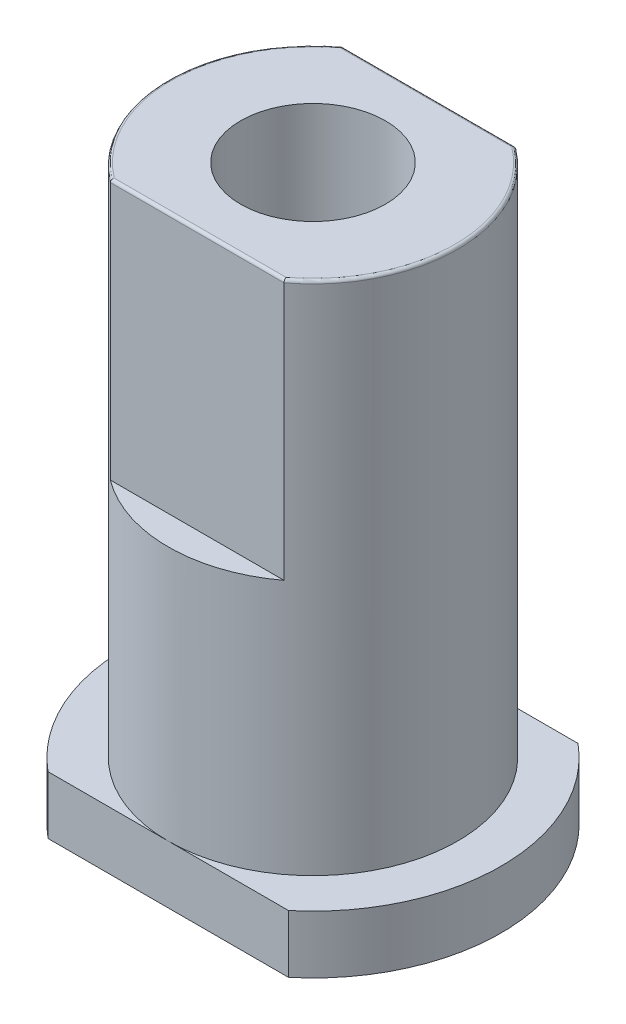
ISO-10303-21;
HEADER;
FILE_DESCRIPTION(('STEP AP214'),'2;1');
FILE_NAME('part.step','',(''),(''),'','','');
FILE_SCHEMA(('AUTOMOTIVE_DESIGN { 1 0 10303 214 1 1 1 1 }'));
ENDSEC;
DATA;
#1=APPLICATION_CONTEXT('core data for automotive mechanical design processes');
#2=APPLICATION_PROTOCOL_DEFINITION('international standard','automotive_design',2000,#1);
#3=PRODUCT_CONTEXT('',#1,'mechanical');
#4=PRODUCT('Part','Part','',(#3));
#5=PRODUCT_RELATED_PRODUCT_CATEGORY('part','',(#4));
#6=PRODUCT_DEFINITION_FORMATION('','',#4);
#7=PRODUCT_DEFINITION_CONTEXT('part definition',#1,'design');
#8=PRODUCT_DEFINITION('design','',#6,#7);
#9=PRODUCT_DEFINITION_SHAPE('','',#8);
#10=(LENGTH_UNIT() NAMED_UNIT(*) SI_UNIT(.MILLI.,.METRE.));
#11=(NAMED_UNIT(*) PLANE_ANGLE_UNIT() SI_UNIT($,.RADIAN.));
#12=(NAMED_UNIT(*) SI_UNIT($,.STERADIAN.) SOLID_ANGLE_UNIT());
#13=UNCERTAINTY_MEASURE_WITH_UNIT(LENGTH_MEASURE(1.E-05),#10,'distance_accuracy_value','');
#14=(GEOMETRIC_REPRESENTATION_CONTEXT(3) GLOBAL_UNCERTAINTY_ASSIGNED_CONTEXT((#13)) GLOBAL_UNIT_ASSIGNED_CONTEXT((#10,
#11,#12)) REPRESENTATION_CONTEXT('',''));
#15=CARTESIAN_POINT('',(0.,0.,0.));
#16=DIRECTION('',(0.,0.,1.));
#17=DIRECTION('',(1.,0.,0.));
#18=AXIS2_PLACEMENT_3D('',#15,#16,#17);
#19=CARTESIAN_POINT('',(0.,17.8,0.));
#20=DIRECTION('',(0.,1.,0.));
#21=DIRECTION('',(0.,0.,1.));
#22=AXIS2_PLACEMENT_3D('',#19,#20,#21);
#23=PLANE('',#22);
#24=CARTESIAN_POINT('',(0.,17.8,0.));
#25=DIRECTION('',(0.,1.,0.));
#26=DIRECTION('',(0.,0.,1.));
#27=AXIS2_PLACEMENT_3D('',#24,#25,#26);
#28=CIRCLE('',#27,4.9);
#29=CARTESIAN_POINT('',(2.96647939483827,17.8,3.9));
#30=VERTEX_POINT('',#29);
#31=CARTESIAN_POINT('',(2.96647939483827,17.8,-3.9));
#32=VERTEX_POINT('',#31);
#33=EDGE_CURVE('E187',#30,#32,#28,.T.);
#34=ORIENTED_EDGE('',*,*,#33,.T.);
#35=DIRECTION('',(1.,0.,0.));
#36=VECTOR('',#35,1.);
#37=CARTESIAN_POINT('',(-3.,17.8,-3.9));
#38=LINE('',#37,#36);
#39=CARTESIAN_POINT('',(-2.96647939483827,17.8,-3.9));
#40=VERTEX_POINT('',#39);
#41=EDGE_CURVE('E189',#32,#40,#38,.F.);
#42=ORIENTED_EDGE('',*,*,#41,.T.);
#43=CARTESIAN_POINT('',(0.,17.8,0.));
#44=DIRECTION('',(0.,1.,0.));
#45=DIRECTION('',(0.,0.,1.));
#46=AXIS2_PLACEMENT_3D('',#43,#44,#45);
#47=CIRCLE('',#46,4.9);
#48=CARTESIAN_POINT('',(-2.96647939483827,17.8,3.9));
#49=VERTEX_POINT('',#48);
#50=EDGE_CURVE('E183',#40,#49,#47,.T.);
#51=ORIENTED_EDGE('',*,*,#50,.T.);
#52=DIRECTION('',(-1.,0.,0.));
#53=VECTOR('',#52,1.);
#54=CARTESIAN_POINT('',(3.,17.8,3.9));
#55=LINE('',#54,#53);
#56=EDGE_CURVE('E185',#49,#30,#55,.F.);
#57=ORIENTED_EDGE('',*,*,#56,.T.);
#58=EDGE_LOOP('',(#34,#42,#51,#57));
#59=FACE_BOUND('',#58,.T.);
#60=CARTESIAN_POINT('',(0.,17.8,0.));
#61=DIRECTION('',(0.,1.,0.));
#62=DIRECTION('',(0.,0.,1.));
#63=AXIS2_PLACEMENT_3D('',#60,#61,#62);
#64=CIRCLE('',#63,2.5);
#65=CARTESIAN_POINT('',(0.,17.8,2.5));
#66=VERTEX_POINT('',#65);
#67=EDGE_CURVE('E172',#66,#66,#64,.T.);
#68=ORIENTED_EDGE('',*,*,#67,.F.);
#69=EDGE_LOOP('',(#68));
#70=FACE_BOUND('',#69,.T.);
#71=ADVANCED_FACE('F35',(#59,#70),#23,.T.);
#72=CARTESIAN_POINT('',(0.,17.8,0.));
#73=DIRECTION('',(0.,-1.,0.));
#74=DIRECTION('',(0.,0.,-1.));
#75=AXIS2_PLACEMENT_3D('',#72,#73,#74);
#76=CYLINDRICAL_SURFACE('',#75,5.);
#77=DIRECTION('',(0.,1.,0.));
#78=VECTOR('',#77,1.);
#79=CARTESIAN_POINT('',(3.,8.8,-4.));
#80=LINE('',#79,#78);
#81=CARTESIAN_POINT('',(3.,8.8,-4.));
#82=VERTEX_POINT('',#81);
#83=CARTESIAN_POINT('',(3.,17.7,-4.));
#84=VERTEX_POINT('',#83);
#85=EDGE_CURVE('E161',#82,#84,#80,.T.);
#86=ORIENTED_EDGE('',*,*,#85,.T.);
#87=CARTESIAN_POINT('',(0.,17.7,0.));
#88=DIRECTION('',(0.,1.,0.));
#89=DIRECTION('',(0.,0.,1.));
#90=AXIS2_PLACEMENT_3D('',#87,#88,#89);
#91=CIRCLE('',#90,5.);
#92=CARTESIAN_POINT('',(3.,17.7,4.));
#93=VERTEX_POINT('',#92);
#94=EDGE_CURVE('E48',#84,#93,#91,.F.);
#95=ORIENTED_EDGE('',*,*,#94,.T.);
#96=DIRECTION('',(0.,1.,0.));
#97=VECTOR('',#96,1.);
#98=CARTESIAN_POINT('',(3.,8.8,4.));
#99=LINE('',#98,#97);
#100=CARTESIAN_POINT('',(3.,8.8,4.));
#101=VERTEX_POINT('',#100);
#102=EDGE_CURVE('E169',#101,#93,#99,.T.);
#103=ORIENTED_EDGE('',*,*,#102,.F.);
#104=CARTESIAN_POINT('',(0.,8.8,0.));
#105=DIRECTION('',(0.,1.,0.));
#106=DIRECTION('',(0.,0.,1.));
#107=AXIS2_PLACEMENT_3D('',#104,#105,#106);
#108=CIRCLE('',#107,5.);
#109=CARTESIAN_POINT('',(-3.,8.8,4.));
#110=VERTEX_POINT('',#109);
#111=EDGE_CURVE('E163',#110,#101,#108,.T.);
#112=ORIENTED_EDGE('',*,*,#111,.F.);
#113=DIRECTION('',(0.,1.,0.));
#114=VECTOR('',#113,1.);
#115=CARTESIAN_POINT('',(-3.,8.8,4.));
#116=LINE('',#115,#114);
#117=CARTESIAN_POINT('',(-3.,17.7,4.));
#118=VERTEX_POINT('',#117);
#119=EDGE_CURVE('E170',#110,#118,#116,.T.);
#120=ORIENTED_EDGE('',*,*,#119,.T.);
#121=CARTESIAN_POINT('',(0.,17.7,0.));
#122=DIRECTION('',(0.,1.,0.));
#123=DIRECTION('',(0.,0.,1.));
#124=AXIS2_PLACEMENT_3D('',#121,#122,#123);
#125=CIRCLE('',#124,5.);
#126=CARTESIAN_POINT('',(-3.,17.7,-4.));
#127=VERTEX_POINT('',#126);
#128=EDGE_CURVE('E192',#118,#127,#125,.F.);
#129=ORIENTED_EDGE('',*,*,#128,.T.);
#130=DIRECTION('',(0.,1.,0.));
#131=VECTOR('',#130,1.);
#132=CARTESIAN_POINT('',(-3.,8.8,-4.));
#133=LINE('',#132,#131);
#134=CARTESIAN_POINT('',(-3.,8.8,-4.));
#135=VERTEX_POINT('',#134);
#136=EDGE_CURVE('E160',#135,#127,#133,.T.);
#137=ORIENTED_EDGE('',*,*,#136,.F.);
#138=CARTESIAN_POINT('',(0.,8.8,0.));
#139=DIRECTION('',(0.,1.,0.));
#140=DIRECTION('',(0.,0.,1.));
#141=AXIS2_PLACEMENT_3D('',#138,#139,#140);
#142=CIRCLE('',#141,5.);
#143=EDGE_CURVE('E151',#82,#135,#142,.T.);
#144=ORIENTED_EDGE('',*,*,#143,.F.);
#145=EDGE_LOOP('',(#86,#95,#103,#112,#120,#129,#137,#144));
#146=FACE_BOUND('',#145,.T.);
#147=CARTESIAN_POINT('',(0.,0.,0.));
#148=DIRECTION('',(0.,1.,0.));
#149=DIRECTION('',(0.,0.,1.));
#150=AXIS2_PLACEMENT_3D('',#147,#148,#149);
#151=CIRCLE('',#150,5.);
#152=CARTESIAN_POINT('',(0.,0.,5.));
#153=VERTEX_POINT('',#152);
#154=CARTESIAN_POINT('',(0.,0.,-5.));
#155=VERTEX_POINT('',#154);
#156=EDGE_CURVE('E177',#153,#155,#151,.T.);
#157=ORIENTED_EDGE('',*,*,#156,.T.);
#158=EDGE_CURVE('E176',#155,#153,#151,.T.);
#159=ORIENTED_EDGE('',*,*,#158,.T.);
#160=EDGE_LOOP('',(#157,#159));
#161=FACE_BOUND('',#160,.T.);
#162=ADVANCED_FACE('F228',(#146,#161),#76,.T.);
#163=CARTESIAN_POINT('',(0.,17.8,0.));
#164=DIRECTION('',(0.,-1.,0.));
#165=DIRECTION('',(0.,0.,-1.));
#166=AXIS2_PLACEMENT_3D('',#163,#164,#165);
#167=CYLINDRICAL_SURFACE('',#166,2.5);
#168=ORIENTED_EDGE('',*,*,#67,.T.);
#169=EDGE_LOOP('',(#168));
#170=FACE_BOUND('',#169,.T.);
#171=CARTESIAN_POINT('',(0.,-2.,0.));
#172=DIRECTION('',(0.,-1.,0.));
#173=DIRECTION('',(0.,0.,-1.));
#174=AXIS2_PLACEMENT_3D('',#171,#172,#173);
#175=CIRCLE('',#174,2.5);
#176=CARTESIAN_POINT('',(0.,-2.,-2.5));
#177=VERTEX_POINT('',#176);
#178=EDGE_CURVE('E299',#177,#177,#175,.T.);
#179=ORIENTED_EDGE('',*,*,#178,.T.);
#180=EDGE_LOOP('',(#179));
#181=FACE_BOUND('',#180,.T.);
#182=ADVANCED_FACE('F234',(#170,#181),#167,.F.);
#183=CARTESIAN_POINT('',(-3.,8.8,4.));
#184=DIRECTION('',(0.,0.,-1.));
#185=DIRECTION('',(-1.,0.,0.));
#186=AXIS2_PLACEMENT_3D('',#183,#184,#185);
#187=PLANE('',#186);
#188=ORIENTED_EDGE('',*,*,#102,.T.);
#189=DIRECTION('',(-1.,0.,0.));
#190=VECTOR('',#189,1.);
#191=CARTESIAN_POINT('',(-3.,17.7,4.));
#192=LINE('',#191,#190);
#193=EDGE_CURVE('E11',#93,#118,#192,.T.);
#194=ORIENTED_EDGE('',*,*,#193,.T.);
#195=ORIENTED_EDGE('',*,*,#119,.F.);
#196=DIRECTION('',(-1.,0.,0.));
#197=VECTOR('',#196,1.);
#198=CARTESIAN_POINT('',(-3.,8.8,4.));
#199=LINE('',#198,#197);
#200=EDGE_CURVE('E167',#101,#110,#199,.T.);
#201=ORIENTED_EDGE('',*,*,#200,.F.);
#202=EDGE_LOOP('',(#188,#194,#195,#201));
#203=FACE_BOUND('',#202,.T.);
#204=ADVANCED_FACE('F239',(#203),#187,.F.);
#205=CARTESIAN_POINT('',(0.,8.8,0.));
#206=DIRECTION('',(0.,1.,0.));
#207=DIRECTION('',(0.,0.,1.));
#208=AXIS2_PLACEMENT_3D('',#205,#206,#207);
#209=PLANE('',#208);
#210=ORIENTED_EDGE('',*,*,#111,.T.);
#211=ORIENTED_EDGE('',*,*,#200,.T.);
#212=EDGE_LOOP('',(#210,#211));
#213=FACE_BOUND('',#212,.T.);
#214=ADVANCED_FACE('F243',(#213),#209,.T.);
#215=CARTESIAN_POINT('',(-3.,8.8,-4.));
#216=DIRECTION('',(0.,0.,1.));
#217=DIRECTION('',(1.,0.,0.));
#218=AXIS2_PLACEMENT_3D('',#215,#216,#217);
#219=PLANE('',#218);
#220=ORIENTED_EDGE('',*,*,#136,.T.);
#221=DIRECTION('',(1.,0.,0.));
#222=VECTOR('',#221,1.);
#223=CARTESIAN_POINT('',(3.,17.7,-4.));
#224=LINE('',#223,#222);
#225=EDGE_CURVE('E180',#127,#84,#224,.T.);
#226=ORIENTED_EDGE('',*,*,#225,.T.);
#227=ORIENTED_EDGE('',*,*,#85,.F.);
#228=DIRECTION('',(1.,0.,0.));
#229=VECTOR('',#228,1.);
#230=CARTESIAN_POINT('',(-3.,8.8,-4.));
#231=LINE('',#230,#229);
#232=EDGE_CURVE('E153',#135,#82,#231,.T.);
#233=ORIENTED_EDGE('',*,*,#232,.F.);
#234=EDGE_LOOP('',(#220,#226,#227,#233));
#235=FACE_BOUND('',#234,.T.);
#236=ADVANCED_FACE('F246',(#235),#219,.F.);
#237=CARTESIAN_POINT('',(0.,8.8,0.));
#238=DIRECTION('',(0.,1.,0.));
#239=DIRECTION('',(0.,0.,1.));
#240=AXIS2_PLACEMENT_3D('',#237,#238,#239);
#241=PLANE('',#240);
#242=ORIENTED_EDGE('',*,*,#143,.T.);
#243=ORIENTED_EDGE('',*,*,#232,.T.);
#244=EDGE_LOOP('',(#242,#243));
#245=FACE_BOUND('',#244,.T.);
#246=ADVANCED_FACE('F250',(#245),#241,.T.);
#247=CARTESIAN_POINT('',(0.,0.,0.));
#248=DIRECTION('',(0.,-1.,0.));
#249=DIRECTION('',(0.,0.,-1.));
#250=AXIS2_PLACEMENT_3D('',#247,#248,#249);
#251=PLANE('',#250);
#252=ORIENTED_EDGE('',*,*,#156,.F.);
#253=DIRECTION('',(-1.,0.,0.));
#254=VECTOR('',#253,1.);
#255=CARTESIAN_POINT('',(-4.15331193145904,0.,5.));
#256=LINE('',#255,#254);
#257=CARTESIAN_POINT('',(4.15331193145904,0.,5.));
#258=VERTEX_POINT('',#257);
#259=EDGE_CURVE('E146',#258,#153,#256,.T.);
#260=ORIENTED_EDGE('',*,*,#259,.F.);
#261=CARTESIAN_POINT('',(0.,0.,0.));
#262=DIRECTION('',(0.,-1.,0.));
#263=DIRECTION('',(0.,0.,-1.));
#264=AXIS2_PLACEMENT_3D('',#261,#262,#263);
#265=CIRCLE('',#264,6.5);
#266=CARTESIAN_POINT('',(4.15331193145904,0.,-5.));
#267=VERTEX_POINT('',#266);
#268=EDGE_CURVE('E288',#267,#258,#265,.T.);
#269=ORIENTED_EDGE('',*,*,#268,.F.);
#270=DIRECTION('',(1.,0.,0.));
#271=VECTOR('',#270,1.);
#272=CARTESIAN_POINT('',(-4.15331193145904,0.,-5.));
#273=LINE('',#272,#271);
#274=EDGE_CURVE('E283',#155,#267,#273,.T.);
#275=ORIENTED_EDGE('',*,*,#274,.F.);
#276=EDGE_LOOP('',(#252,#260,#269,#275));
#277=FACE_BOUND('',#276,.T.);
#278=ADVANCED_FACE('F254',(#277),#251,.F.);
#279=CARTESIAN_POINT('',(0.,-2.,0.));
#280=DIRECTION('',(0.,-1.,0.));
#281=DIRECTION('',(0.,0.,-1.));
#282=AXIS2_PLACEMENT_3D('',#279,#280,#281);
#283=PLANE('',#282);
#284=CARTESIAN_POINT('',(0.,-2.,0.));
#285=DIRECTION('',(0.,-1.,0.));
#286=DIRECTION('',(0.,0.,-1.));
#287=AXIS2_PLACEMENT_3D('',#284,#285,#286);
#288=CIRCLE('',#287,6.5);
#289=CARTESIAN_POINT('',(-4.15331193145904,-2.,5.));
#290=VERTEX_POINT('',#289);
#291=CARTESIAN_POINT('',(-4.15331193145904,-2.,-5.));
#292=VERTEX_POINT('',#291);
#293=EDGE_CURVE('E136',#290,#292,#288,.T.);
#294=ORIENTED_EDGE('',*,*,#293,.T.);
#295=DIRECTION('',(1.,0.,0.));
#296=VECTOR('',#295,1.);
#297=CARTESIAN_POINT('',(-4.15331193145904,-2.,-5.));
#298=LINE('',#297,#296);
#299=CARTESIAN_POINT('',(4.15331193145904,-2.,-5.));
#300=VERTEX_POINT('',#299);
#301=EDGE_CURVE('E124',#292,#300,#298,.T.);
#302=ORIENTED_EDGE('',*,*,#301,.T.);
#303=CARTESIAN_POINT('',(0.,-2.,0.));
#304=DIRECTION('',(0.,-1.,0.));
#305=DIRECTION('',(0.,0.,-1.));
#306=AXIS2_PLACEMENT_3D('',#303,#304,#305);
#307=CIRCLE('',#306,6.5);
#308=CARTESIAN_POINT('',(4.15331193145904,-2.,5.));
#309=VERTEX_POINT('',#308);
#310=EDGE_CURVE('E135',#300,#309,#307,.T.);
#311=ORIENTED_EDGE('',*,*,#310,.T.);
#312=DIRECTION('',(-1.,0.,0.));
#313=VECTOR('',#312,1.);
#314=CARTESIAN_POINT('',(-4.15331193145904,-2.,5.));
#315=LINE('',#314,#313);
#316=EDGE_CURVE('E142',#309,#290,#315,.T.);
#317=ORIENTED_EDGE('',*,*,#316,.T.);
#318=EDGE_LOOP('',(#294,#302,#311,#317));
#319=FACE_BOUND('',#318,.T.);
#320=ORIENTED_EDGE('',*,*,#178,.F.);
#321=EDGE_LOOP('',(#320));
#322=FACE_BOUND('',#321,.T.);
#323=ADVANCED_FACE('F139',(#319,#322),#283,.T.);
#324=ORIENTED_EDGE('',*,*,#158,.F.);
#325=CARTESIAN_POINT('',(-4.15331193145904,0.,-5.));
#326=VERTEX_POINT('',#325);
#327=EDGE_CURVE('E286',#326,#155,#273,.T.);
#328=ORIENTED_EDGE('',*,*,#327,.F.);
#329=CARTESIAN_POINT('',(0.,0.,0.));
#330=DIRECTION('',(0.,-1.,0.));
#331=DIRECTION('',(0.,0.,-1.));
#332=AXIS2_PLACEMENT_3D('',#329,#330,#331);
#333=CIRCLE('',#332,6.5);
#334=CARTESIAN_POINT('',(-4.15331193145904,0.,5.));
#335=VERTEX_POINT('',#334);
#336=EDGE_CURVE('E150',#335,#326,#333,.T.);
#337=ORIENTED_EDGE('',*,*,#336,.F.);
#338=EDGE_CURVE('E287',#153,#335,#256,.T.);
#339=ORIENTED_EDGE('',*,*,#338,.F.);
#340=EDGE_LOOP('',(#324,#328,#337,#339));
#341=FACE_BOUND('',#340,.T.);
#342=ADVANCED_FACE('F258',(#341),#251,.F.);
#343=CARTESIAN_POINT('',(0.,-2.,0.));
#344=DIRECTION('',(0.,1.,0.));
#345=DIRECTION('',(0.,0.,1.));
#346=AXIS2_PLACEMENT_3D('',#343,#344,#345);
#347=CYLINDRICAL_SURFACE('',#346,6.5);
#348=ORIENTED_EDGE('',*,*,#336,.T.);
#349=DIRECTION('',(0.,1.,0.));
#350=VECTOR('',#349,1.);
#351=CARTESIAN_POINT('',(-4.15331193145904,-2.,-5.));
#352=LINE('',#351,#350);
#353=EDGE_CURVE('E129',#292,#326,#352,.T.);
#354=ORIENTED_EDGE('',*,*,#353,.F.);
#355=ORIENTED_EDGE('',*,*,#293,.F.);
#356=DIRECTION('',(0.,1.,0.));
#357=VECTOR('',#356,1.);
#358=CARTESIAN_POINT('',(-4.15331193145904,-2.,5.));
#359=LINE('',#358,#357);
#360=EDGE_CURVE('E293',#290,#335,#359,.T.);
#361=ORIENTED_EDGE('',*,*,#360,.T.);
#362=EDGE_LOOP('',(#348,#354,#355,#361));
#363=FACE_BOUND('',#362,.T.);
#364=ADVANCED_FACE('F148',(#363),#347,.T.);
#365=CARTESIAN_POINT('',(-4.15331193145904,-2.,-5.));
#366=DIRECTION('',(0.,0.,1.));
#367=DIRECTION('',(1.,0.,0.));
#368=AXIS2_PLACEMENT_3D('',#365,#366,#367);
#369=PLANE('',#368);
#370=ORIENTED_EDGE('',*,*,#327,.T.);
#371=ORIENTED_EDGE('',*,*,#274,.T.);
#372=DIRECTION('',(0.,1.,0.));
#373=VECTOR('',#372,1.);
#374=CARTESIAN_POINT('',(4.15331193145904,-2.,-5.));
#375=LINE('',#374,#373);
#376=EDGE_CURVE('E132',#300,#267,#375,.T.);
#377=ORIENTED_EDGE('',*,*,#376,.F.);
#378=ORIENTED_EDGE('',*,*,#301,.F.);
#379=ORIENTED_EDGE('',*,*,#353,.T.);
#380=EDGE_LOOP('',(#370,#371,#377,#378,#379));
#381=FACE_BOUND('',#380,.T.);
#382=ADVANCED_FACE('F127',(#381),#369,.F.);
#383=CARTESIAN_POINT('',(0.,-2.,0.));
#384=DIRECTION('',(0.,1.,0.));
#385=DIRECTION('',(0.,0.,1.));
#386=AXIS2_PLACEMENT_3D('',#383,#384,#385);
#387=CYLINDRICAL_SURFACE('',#386,6.5);
#388=ORIENTED_EDGE('',*,*,#268,.T.);
#389=DIRECTION('',(0.,1.,0.));
#390=VECTOR('',#389,1.);
#391=CARTESIAN_POINT('',(4.15331193145904,-2.,5.));
#392=LINE('',#391,#390);
#393=EDGE_CURVE('E155',#309,#258,#392,.T.);
#394=ORIENTED_EDGE('',*,*,#393,.F.);
#395=ORIENTED_EDGE('',*,*,#310,.F.);
#396=ORIENTED_EDGE('',*,*,#376,.T.);
#397=EDGE_LOOP('',(#388,#394,#395,#396));
#398=FACE_BOUND('',#397,.T.);
#399=ADVANCED_FACE('F261',(#398),#387,.T.);
#400=CARTESIAN_POINT('',(-4.15331193145904,-2.,5.));
#401=DIRECTION('',(0.,0.,-1.));
#402=DIRECTION('',(-1.,0.,0.));
#403=AXIS2_PLACEMENT_3D('',#400,#401,#402);
#404=PLANE('',#403);
#405=ORIENTED_EDGE('',*,*,#259,.T.);
#406=ORIENTED_EDGE('',*,*,#338,.T.);
#407=ORIENTED_EDGE('',*,*,#360,.F.);
#408=ORIENTED_EDGE('',*,*,#316,.F.);
#409=ORIENTED_EDGE('',*,*,#393,.T.);
#410=EDGE_LOOP('',(#405,#406,#407,#408,#409));
#411=FACE_BOUND('',#410,.T.);
#412=ADVANCED_FACE('F224',(#411),#404,.F.);
#413=CARTESIAN_POINT('',(-3.,17.7,3.9));
#414=DIRECTION('',(1.,0.,0.));
#415=DIRECTION('',(0.,0.,-1.));
#416=AXIS2_PLACEMENT_3D('',#413,#414,#415);
#417=CYLINDRICAL_SURFACE('',#416,0.1);
#418=CARTESIAN_POINT('',(3.,17.7,4.));
#419=CARTESIAN_POINT('',(3.00000183847308,17.7054170925373,4.00000564145487));
#420=CARTESIAN_POINT('',(2.99985340175468,17.7108310860563,3.9995602064721));
#421=CARTESIAN_POINT('',(2.99927016579746,17.721491219137,3.99781068815657));
#422=CARTESIAN_POINT('',(2.9988359792692,17.7267376927164,3.99650844201732));
#423=CARTESIAN_POINT('',(2.99769533420545,17.7369254611876,3.99308850635295));
#424=CARTESIAN_POINT('',(2.99698888133973,17.7418667624318,3.99097083380855));
#425=CARTESIAN_POINT('',(2.99532825802468,17.7513157092276,3.98599534085031));
#426=CARTESIAN_POINT('',(2.99437404555982,17.7558232810486,3.98313739489968));
#427=CARTESIAN_POINT('',(2.99222508225233,17.7643867809392,3.97670488430193));
#428=CARTESIAN_POINT('',(2.99102561028449,17.7684309453255,3.97311626130895));
#429=CARTESIAN_POINT('',(2.98843551009433,17.7758633582513,3.96537256122173));
#430=CARTESIAN_POINT('',(2.98704480931703,17.7792513566511,3.96121726913006));
#431=CARTESIAN_POINT('',(2.98403925717243,17.7854502433735,3.95224396192257));
#432=CARTESIAN_POINT('',(2.98241677873181,17.7882248963539,3.94740350035313));
#433=CARTESIAN_POINT('',(2.97904930189736,17.7929218371565,3.93736595726991));
#434=CARTESIAN_POINT('',(2.97730432802446,17.7948442950091,3.93216894713405));
#435=CARTESIAN_POINT('',(2.9741809974817,17.7974366511522,3.92287540025435));
#436=CARTESIAN_POINT('',(2.9728190243604,17.7982989344188,3.91882552895719));
#437=CARTESIAN_POINT('',(2.97007205118352,17.7995151792123,3.91066305498305));
#438=CARTESIAN_POINT('',(2.96868709294396,17.799869979209,3.90655056715279));
#439=CARTESIAN_POINT('',(2.96702676502524,17.7999901312324,3.90162387308815));
#440=CARTESIAN_POINT('',(2.96675307216613,17.8000000254172,3.90081185663029));
#441=CARTESIAN_POINT('',(2.96647939483827,17.8,3.9));
#442=B_SPLINE_CURVE_WITH_KNOTS('',3,(#418,#419,#420,#421,#422,#423,#424,#425,#426,#427,#428,
#429,#430,#431,#432,#433,#434,#435,#436,#437,#438,#439,#440,#441),.UNSPECIFIED.,.F.,.F.,(4,2,2,
2,2,2,2,2,2,2,2,4),(0.,0.0162262134724958,0.0324177472315451,0.0486089438309041,
0.0648028879596489,0.0813442418868736,0.0978918892482303,0.115247135729005,0.132598917921508,
0.145648093244819,0.158675683567009,0.161246294191106),.UNSPECIFIED.);
#443=EDGE_CURVE('E304',#30,#93,#442,.F.);
#444=ORIENTED_EDGE('',*,*,#443,.F.);
#445=ORIENTED_EDGE('',*,*,#56,.F.);
#446=CARTESIAN_POINT('',(-3.,17.7,4.));
#447=CARTESIAN_POINT('',(-3.00000183847308,17.7054170925373,4.00000564145487));
#448=CARTESIAN_POINT('',(-2.99985340175468,17.7108310860563,3.9995602064721));
#449=CARTESIAN_POINT('',(-2.99927016579746,17.721491219137,3.99781068815657));
#450=CARTESIAN_POINT('',(-2.9988359792692,17.7267376927164,3.99650844201732));
#451=CARTESIAN_POINT('',(-2.99769533420545,17.7369254611876,3.99308850635295));
#452=CARTESIAN_POINT('',(-2.99698888133973,17.7418667624318,3.99097083380855));
#453=CARTESIAN_POINT('',(-2.99532825802468,17.7513157092276,3.98599534085031));
#454=CARTESIAN_POINT('',(-2.99437404555982,17.7558232810486,3.98313739489968));
#455=CARTESIAN_POINT('',(-2.99222508225233,17.7643867809392,3.97670488430193));
#456=CARTESIAN_POINT('',(-2.99102561028449,17.7684309453255,3.97311626130895));
#457=CARTESIAN_POINT('',(-2.98843551009433,17.7758633582513,3.96537256122173));
#458=CARTESIAN_POINT('',(-2.98704480931703,17.7792513566511,3.96121726913006));
#459=CARTESIAN_POINT('',(-2.98403925717243,17.7854502433735,3.95224396192257));
#460=CARTESIAN_POINT('',(-2.98241677873181,17.7882248963539,3.94740350035313));
#461=CARTESIAN_POINT('',(-2.97904930189736,17.7929218371565,3.93736595726991));
#462=CARTESIAN_POINT('',(-2.97730432802446,17.7948442950091,3.93216894713405));
#463=CARTESIAN_POINT('',(-2.9741809974817,17.7974366511522,3.92287540025435));
#464=CARTESIAN_POINT('',(-2.9728190243604,17.7982989344188,3.91882552895719));
#465=CARTESIAN_POINT('',(-2.97007205118352,17.7995151792123,3.91066305498305));
#466=CARTESIAN_POINT('',(-2.96868709294396,17.799869979209,3.90655056715279));
#467=CARTESIAN_POINT('',(-2.96702676502524,17.7999901312324,3.90162387308815));
#468=CARTESIAN_POINT('',(-2.96675307216613,17.8000000254172,3.90081185663029));
#469=CARTESIAN_POINT('',(-2.96647939483827,17.8,3.9));
#470=B_SPLINE_CURVE_WITH_KNOTS('',3,(#446,#447,#448,#449,#450,#451,#452,#453,#454,#455,#456,
#457,#458,#459,#460,#461,#462,#463,#464,#465,#466,#467,#468,#469),.UNSPECIFIED.,.F.,.F.,(4,2,2,
2,2,2,2,2,2,2,2,4),(0.,0.0162262134724958,0.0324177472315451,0.0486089438309041,
0.0648028879596489,0.0813442418868736,0.0978918892482303,0.115247135729005,0.132598917921508,
0.145648093244819,0.158675683567009,0.161246294191106),.UNSPECIFIED.);
#471=EDGE_CURVE('E40',#118,#49,#470,.T.);
#472=ORIENTED_EDGE('',*,*,#471,.F.);
#473=ORIENTED_EDGE('',*,*,#193,.F.);
#474=EDGE_LOOP('',(#444,#445,#472,#473));
#475=FACE_BOUND('',#474,.T.);
#476=ADVANCED_FACE('F37',(#475),#417,.T.);
#477=CARTESIAN_POINT('',(0.,17.7,0.));
#478=DIRECTION('',(0.,1.,0.));
#479=DIRECTION('',(0.,0.,1.));
#480=AXIS2_PLACEMENT_3D('',#477,#478,#479);
#481=TOROIDAL_SURFACE('',#480,4.9,0.1);
#482=ORIENTED_EDGE('',*,*,#471,.T.);
#483=ORIENTED_EDGE('',*,*,#50,.F.);
#484=CARTESIAN_POINT('',(-3.,17.7,-4.));
#485=CARTESIAN_POINT('',(-3.00000183847308,17.7054170925373,-4.00000564145487));
#486=CARTESIAN_POINT('',(-2.99985340175468,17.7108310860563,-3.9995602064721));
#487=CARTESIAN_POINT('',(-2.99927016579746,17.721491219137,-3.99781068815657));
#488=CARTESIAN_POINT('',(-2.9988359792692,17.7267376927164,-3.99650844201732));
#489=CARTESIAN_POINT('',(-2.99769533420545,17.7369254611876,-3.99308850635295));
#490=CARTESIAN_POINT('',(-2.99698888133973,17.7418667624318,-3.99097083380855));
#491=CARTESIAN_POINT('',(-2.99532825802468,17.7513157092276,-3.98599534085031));
#492=CARTESIAN_POINT('',(-2.99437404555982,17.7558232810486,-3.98313739489968));
#493=CARTESIAN_POINT('',(-2.99222508225233,17.7643867809392,-3.97670488430193));
#494=CARTESIAN_POINT('',(-2.99102561028449,17.7684309453255,-3.97311626130895));
#495=CARTESIAN_POINT('',(-2.98843551009433,17.7758633582513,-3.96537256122173));
#496=CARTESIAN_POINT('',(-2.98704480931703,17.7792513566511,-3.96121726913006));
#497=CARTESIAN_POINT('',(-2.98403925717243,17.7854502433735,-3.95224396192257));
#498=CARTESIAN_POINT('',(-2.98241677873181,17.7882248963539,-3.94740350035313));
#499=CARTESIAN_POINT('',(-2.97904930189736,17.7929218371565,-3.93736595726991));
#500=CARTESIAN_POINT('',(-2.97730432802446,17.7948442950091,-3.93216894713405));
#501=CARTESIAN_POINT('',(-2.9741809974817,17.7974366511522,-3.92287540025435));
#502=CARTESIAN_POINT('',(-2.9728190243604,17.7982989344188,-3.91882552895719));
#503=CARTESIAN_POINT('',(-2.97007205118352,17.7995151792123,-3.91066305498305));
#504=CARTESIAN_POINT('',(-2.96868709294396,17.799869979209,-3.90655056715279));
#505=CARTESIAN_POINT('',(-2.96702676502524,17.7999901312324,-3.90162387308815));
#506=CARTESIAN_POINT('',(-2.96675307216613,17.8000000254172,-3.90081185663029));
#507=CARTESIAN_POINT('',(-2.96647939483827,17.8,-3.9));
#508=B_SPLINE_CURVE_WITH_KNOTS('',3,(#484,#485,#486,#487,#488,#489,#490,#491,#492,#493,#494,
#495,#496,#497,#498,#499,#500,#501,#502,#503,#504,#505,#506,#507),.UNSPECIFIED.,.F.,.F.,(4,2,2,
2,2,2,2,2,2,2,2,4),(0.,0.0162262134724958,0.0324177472315451,0.0486089438309041,
0.0648028879596489,0.0813442418868736,0.0978918892482303,0.115247135729005,0.132598917921508,
0.145648093244819,0.158675683567009,0.161246294191106),.UNSPECIFIED.);
#509=EDGE_CURVE('E202',#127,#40,#508,.T.);
#510=ORIENTED_EDGE('',*,*,#509,.F.);
#511=ORIENTED_EDGE('',*,*,#128,.F.);
#512=EDGE_LOOP('',(#482,#483,#510,#511));
#513=FACE_BOUND('',#512,.T.);
#514=ADVANCED_FACE('F213',(#513),#481,.T.);
#515=CARTESIAN_POINT('',(0.,17.7,0.));
#516=DIRECTION('',(0.,1.,0.));
#517=DIRECTION('',(0.,0.,1.));
#518=AXIS2_PLACEMENT_3D('',#515,#516,#517);
#519=TOROIDAL_SURFACE('',#518,4.9,0.1);
#520=ORIENTED_EDGE('',*,*,#443,.T.);
#521=ORIENTED_EDGE('',*,*,#94,.F.);
#522=CARTESIAN_POINT('',(3.,17.7,-4.));
#523=CARTESIAN_POINT('',(3.00000183847308,17.7054170925373,-4.00000564145487));
#524=CARTESIAN_POINT('',(2.99985340175468,17.7108310860563,-3.9995602064721));
#525=CARTESIAN_POINT('',(2.99927016579746,17.721491219137,-3.99781068815657));
#526=CARTESIAN_POINT('',(2.9988359792692,17.7267376927164,-3.99650844201732));
#527=CARTESIAN_POINT('',(2.99769533420545,17.7369254611876,-3.99308850635295));
#528=CARTESIAN_POINT('',(2.99698888133973,17.7418667624318,-3.99097083380855));
#529=CARTESIAN_POINT('',(2.99532825802468,17.7513157092276,-3.98599534085031));
#530=CARTESIAN_POINT('',(2.99437404555982,17.7558232810486,-3.98313739489968));
#531=CARTESIAN_POINT('',(2.99222508225233,17.7643867809392,-3.97670488430193));
#532=CARTESIAN_POINT('',(2.99102561028449,17.7684309453255,-3.97311626130895));
#533=CARTESIAN_POINT('',(2.98843551009433,17.7758633582513,-3.96537256122173));
#534=CARTESIAN_POINT('',(2.98704480931703,17.7792513566511,-3.96121726913006));
#535=CARTESIAN_POINT('',(2.98403925717243,17.7854502433735,-3.95224396192257));
#536=CARTESIAN_POINT('',(2.98241677873181,17.7882248963539,-3.94740350035313));
#537=CARTESIAN_POINT('',(2.97904930189736,17.7929218371565,-3.93736595726991));
#538=CARTESIAN_POINT('',(2.97730432802446,17.7948442950091,-3.93216894713405));
#539=CARTESIAN_POINT('',(2.9741809974817,17.7974366511522,-3.92287540025435));
#540=CARTESIAN_POINT('',(2.9728190243604,17.7982989344188,-3.91882552895719));
#541=CARTESIAN_POINT('',(2.97007205118352,17.7995151792123,-3.91066305498305));
#542=CARTESIAN_POINT('',(2.96868709294396,17.799869979209,-3.90655056715279));
#543=CARTESIAN_POINT('',(2.96702676502524,17.7999901312324,-3.90162387308815));
#544=CARTESIAN_POINT('',(2.96675307216613,17.8000000254172,-3.90081185663029));
#545=CARTESIAN_POINT('',(2.96647939483827,17.8,-3.9));
#546=B_SPLINE_CURVE_WITH_KNOTS('',3,(#522,#523,#524,#525,#526,#527,#528,#529,#530,#531,#532,
#533,#534,#535,#536,#537,#538,#539,#540,#541,#542,#543,#544,#545),.UNSPECIFIED.,.F.,.F.,(4,2,2,
2,2,2,2,2,2,2,2,4),(0.,0.0162262134724958,0.0324177472315451,0.0486089438309041,
0.0648028879596489,0.0813442418868736,0.0978918892482303,0.115247135729005,0.132598917921508,
0.145648093244819,0.158675683567009,0.161246294191106),.UNSPECIFIED.);
#547=EDGE_CURVE('E195',#32,#84,#546,.F.);
#548=ORIENTED_EDGE('',*,*,#547,.F.);
#549=ORIENTED_EDGE('',*,*,#33,.F.);
#550=EDGE_LOOP('',(#520,#521,#548,#549));
#551=FACE_BOUND('',#550,.T.);
#552=ADVANCED_FACE('F206',(#551),#519,.T.);
#553=CARTESIAN_POINT('',(-3.,17.7,-3.9));
#554=DIRECTION('',(-1.,0.,0.));
#555=DIRECTION('',(0.,0.,1.));
#556=AXIS2_PLACEMENT_3D('',#553,#554,#555);
#557=CYLINDRICAL_SURFACE('',#556,0.1);
#558=ORIENTED_EDGE('',*,*,#509,.T.);
#559=ORIENTED_EDGE('',*,*,#41,.F.);
#560=ORIENTED_EDGE('',*,*,#547,.T.);
#561=ORIENTED_EDGE('',*,*,#225,.F.);
#562=EDGE_LOOP('',(#558,#559,#560,#561));
#563=FACE_BOUND('',#562,.T.);
#564=ADVANCED_FACE('F209',(#563),#557,.T.);
#565=CLOSED_SHELL('',(#71,#162,#182,#204,#214,#236,#246,#278,#323,#342,#364,#382,#399,#412,#476,
#514,#552,#564));
#566=MANIFOLD_SOLID_BREP('B2',#565);
#567=ADVANCED_BREP_SHAPE_REPRESENTATION('',(#18,#566),#14);
#568=SHAPE_DEFINITION_REPRESENTATION(#9,#567);
ENDSEC;
END-ISO-10303-21;
